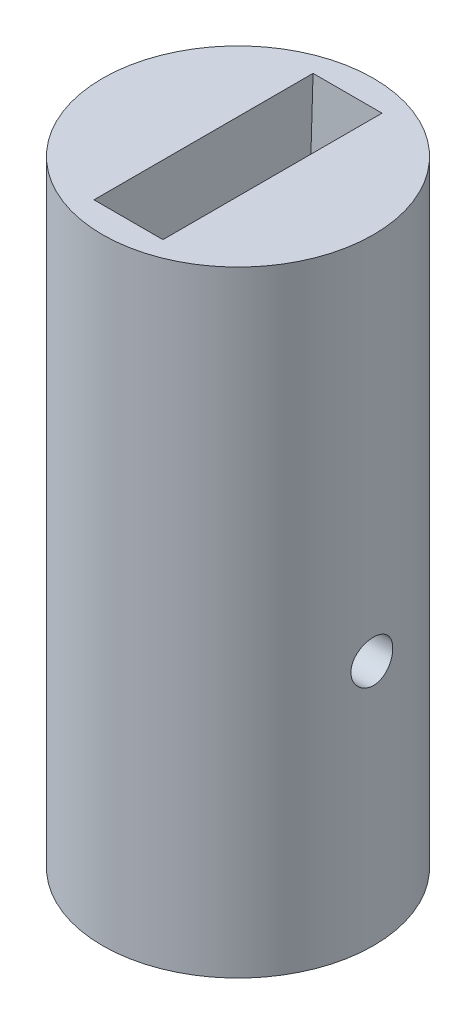
ISO-10303-21;
HEADER;
FILE_DESCRIPTION(('STEP AP214'),'2;1');
FILE_NAME('part.step','',(''),(''),'','','');
FILE_SCHEMA(('AUTOMOTIVE_DESIGN { 1 0 10303 214 1 1 1 1 }'));
ENDSEC;
DATA;
#1=APPLICATION_CONTEXT('core data for automotive mechanical design processes');
#2=APPLICATION_PROTOCOL_DEFINITION('international standard','automotive_design',2000,#1);
#3=PRODUCT_CONTEXT('',#1,'mechanical');
#4=PRODUCT('Part','Part','',(#3));
#5=PRODUCT_RELATED_PRODUCT_CATEGORY('part','',(#4));
#6=PRODUCT_DEFINITION_FORMATION('','',#4);
#7=PRODUCT_DEFINITION_CONTEXT('part definition',#1,'design');
#8=PRODUCT_DEFINITION('design','',#6,#7);
#9=PRODUCT_DEFINITION_SHAPE('','',#8);
#10=(LENGTH_UNIT() NAMED_UNIT(*) SI_UNIT(.MILLI.,.METRE.));
#11=(NAMED_UNIT(*) PLANE_ANGLE_UNIT() SI_UNIT($,.RADIAN.));
#12=(NAMED_UNIT(*) SI_UNIT($,.STERADIAN.) SOLID_ANGLE_UNIT());
#13=UNCERTAINTY_MEASURE_WITH_UNIT(LENGTH_MEASURE(1.E-05),#10,'distance_accuracy_value','');
#14=(GEOMETRIC_REPRESENTATION_CONTEXT(3) GLOBAL_UNCERTAINTY_ASSIGNED_CONTEXT((#13)) GLOBAL_UNIT_ASSIGNED_CONTEXT((#10,
#11,#12)) REPRESENTATION_CONTEXT('',''));
#15=CARTESIAN_POINT('',(0.,0.,0.));
#16=DIRECTION('',(0.,0.,1.));
#17=DIRECTION('',(1.,0.,0.));
#18=AXIS2_PLACEMENT_3D('',#15,#16,#17);
#19=CARTESIAN_POINT('',(0.,-335.,-11.));
#20=DIRECTION('',(0.,1.,0.));
#21=DIRECTION('',(0.,0.,1.));
#22=AXIS2_PLACEMENT_3D('',#19,#20,#21);
#23=PLANE('',#22);
#24=CARTESIAN_POINT('',(0.,-335.,0.));
#25=DIRECTION('',(0.,-1.,0.));
#26=DIRECTION('',(0.,0.,-1.));
#27=AXIS2_PLACEMENT_3D('',#24,#25,#26);
#28=CIRCLE('',#27,11.);
#29=CARTESIAN_POINT('',(0.,-335.,-11.));
#30=VERTEX_POINT('',#29);
#31=EDGE_CURVE('E129',#30,#30,#28,.T.);
#32=ORIENTED_EDGE('',*,*,#31,.F.);
#33=EDGE_LOOP('',(#32));
#34=FACE_BOUND('',#33,.T.);
#35=DIRECTION('',(-1.,0.,0.));
#36=VECTOR('',#35,1.);
#37=CARTESIAN_POINT('',(0.,-335.,8.89487826114935));
#38=LINE('',#37,#36);
#39=CARTESIAN_POINT('',(2.8,-335.,8.89487826114934));
#40=VERTEX_POINT('',#39);
#41=CARTESIAN_POINT('',(-2.8,-335.,8.89487826114934));
#42=VERTEX_POINT('',#41);
#43=EDGE_CURVE('E141',#40,#42,#38,.T.);
#44=ORIENTED_EDGE('',*,*,#43,.T.);
#45=DIRECTION('',(0.,0.,-1.));
#46=VECTOR('',#45,1.);
#47=CARTESIAN_POINT('',(-2.8,-335.,-11.));
#48=LINE('',#47,#46);
#49=CARTESIAN_POINT('',(-2.8,-335.,-8.89487826114943));
#50=VERTEX_POINT('',#49);
#51=EDGE_CURVE('E75',#42,#50,#48,.T.);
#52=ORIENTED_EDGE('',*,*,#51,.T.);
#53=DIRECTION('',(-1.,0.,0.));
#54=VECTOR('',#53,1.);
#55=CARTESIAN_POINT('',(0.,-335.,-8.89487826114943));
#56=LINE('',#55,#54);
#57=CARTESIAN_POINT('',(2.8,-335.,-8.89487826114943));
#58=VERTEX_POINT('',#57);
#59=EDGE_CURVE('E144',#58,#50,#56,.T.);
#60=ORIENTED_EDGE('',*,*,#59,.F.);
#61=DIRECTION('',(0.,0.,-1.));
#62=VECTOR('',#61,1.);
#63=CARTESIAN_POINT('',(2.8,-335.,-11.));
#64=LINE('',#63,#62);
#65=EDGE_CURVE('E138',#40,#58,#64,.T.);
#66=ORIENTED_EDGE('',*,*,#65,.F.);
#67=EDGE_LOOP('',(#44,#52,#60,#66));
#68=FACE_BOUND('',#67,.T.);
#69=ADVANCED_FACE('F47',(#34,#68),#23,.T.);
#70=CARTESIAN_POINT('',(0.,-385.,0.));
#71=DIRECTION('',(0.,-1.,0.));
#72=DIRECTION('',(0.,0.,-1.));
#73=AXIS2_PLACEMENT_3D('',#70,#71,#72);
#74=PLANE('',#73);
#75=CARTESIAN_POINT('',(0.,-385.,0.));
#76=DIRECTION('',(0.,-1.,0.));
#77=DIRECTION('',(0.,0.,-1.));
#78=AXIS2_PLACEMENT_3D('',#75,#76,#77);
#79=CIRCLE('',#78,11.);
#80=CARTESIAN_POINT('',(0.,-385.,-11.));
#81=VERTEX_POINT('',#80);
#82=EDGE_CURVE('E134',#81,#81,#79,.T.);
#83=ORIENTED_EDGE('',*,*,#82,.T.);
#84=EDGE_LOOP('',(#83));
#85=FACE_BOUND('',#84,.T.);
#86=ADVANCED_FACE('F49',(#85),#74,.T.);
#87=CARTESIAN_POINT('',(0.,-385.,0.));
#88=DIRECTION('',(0.,-1.,0.));
#89=DIRECTION('',(0.,0.,-1.));
#90=AXIS2_PLACEMENT_3D('',#87,#88,#89);
#91=CYLINDRICAL_SURFACE('',#90,11.);
#92=CARTESIAN_POINT('',(-11.,-366.7,0.));
#93=CARTESIAN_POINT('',(-10.9999984482941,-366.699996114041,0.0948835861591596));
#94=CARTESIAN_POINT('',(-10.9987594870093,-366.692029446768,0.189821371080059));
#95=CARTESIAN_POINT('',(-10.9939362822614,-366.66038269678,0.37704090923463));
#96=CARTESIAN_POINT('',(-10.9903497885905,-366.636687537342,0.469320025330165));
#97=CARTESIAN_POINT('',(-10.9812343585268,-366.574310740772,0.648485891342021));
#98=CARTESIAN_POINT('',(-10.975706922455,-366.535640676663,0.735376745442714));
#99=CARTESIAN_POINT('',(-10.9633195919169,-366.444440597443,0.90142366978662));
#100=CARTESIAN_POINT('',(-10.9564598739117,-366.391912417513,0.980580762283575));
#101=CARTESIAN_POINT('',(-10.9421067251764,-366.274024404709,1.12958068695421));
#102=CARTESIAN_POINT('',(-10.9346089811336,-366.2085725059,1.19935026926988));
#103=CARTESIAN_POINT('',(-10.9198583855495,-366.06689313283,1.32696248394103));
#104=CARTESIAN_POINT('',(-10.9126055484642,-365.990665023865,1.38480441327966));
#105=CARTESIAN_POINT('',(-10.8991241357353,-365.829101960889,1.48720679156915));
#106=CARTESIAN_POINT('',(-10.8929011346534,-365.74372131749,1.53169595277506));
#107=CARTESIAN_POINT('',(-10.8822431391782,-365.566587094549,1.60567426215004));
#108=CARTESIAN_POINT('',(-10.8778080412662,-365.474833884336,1.63516427878734));
#109=CARTESIAN_POINT('',(-10.8712705636067,-365.288331098517,1.67807881398665));
#110=CARTESIAN_POINT('',(-10.8691499429063,-365.193611096094,1.69162902500299));
#111=CARTESIAN_POINT('',(-10.8674262006969,-365.003219855432,1.70266877817375));
#112=CARTESIAN_POINT('',(-10.8678229258558,-364.907548675484,1.70015929852827));
#113=CARTESIAN_POINT('',(-10.871072376853,-364.718861185218,1.67925353439083));
#114=CARTESIAN_POINT('',(-10.8739034115981,-364.625828902107,1.66099755577315));
#115=CARTESIAN_POINT('',(-10.8816685931841,-364.444163979195,1.60933679398689));
#116=CARTESIAN_POINT('',(-10.8866028028604,-364.355531470933,1.5759315582114));
#117=CARTESIAN_POINT('',(-10.8980421943044,-364.18475696404,1.49477557620756));
#118=CARTESIAN_POINT('',(-10.9045538284425,-364.102643511655,1.44696570761989));
#119=CARTESIAN_POINT('',(-10.9184097575467,-363.947551454328,1.33839967765817));
#120=CARTESIAN_POINT('',(-10.9257541104525,-363.874573485767,1.27764261517286));
#121=CARTESIAN_POINT('',(-10.9405436543939,-363.739011073384,1.14413820456969));
#122=CARTESIAN_POINT('',(-10.947989087583,-363.6765453302,1.07127029088421));
#123=CARTESIAN_POINT('',(-10.9620694815853,-363.56471102439,0.916022716930924));
#124=CARTESIAN_POINT('',(-10.9687044384429,-363.515342525685,0.833643010244094));
#125=CARTESIAN_POINT('',(-10.9804238583599,-363.431096765755,0.66160513033243));
#126=CARTESIAN_POINT('',(-10.9855073036549,-363.396229011349,0.571942228070129));
#127=CARTESIAN_POINT('',(-10.9935425210384,-363.342079526527,0.3879373509025));
#128=CARTESIAN_POINT('',(-10.9964944461937,-363.322796676928,0.293595712502456));
#129=CARTESIAN_POINT('',(-10.9999136674749,-363.300523017503,0.103935482200981));
#130=CARTESIAN_POINT('',(-11.0004058401472,-363.297369081354,0.0086364800028967));
#131=CARTESIAN_POINT('',(-10.9989179282333,-363.307009286892,-0.181129187088976));
#132=CARTESIAN_POINT('',(-10.9969379250371,-363.319802903547,-0.2755958792813));
#133=CARTESIAN_POINT('',(-10.9907435241059,-363.36083939177,-0.460518687924851));
#134=CARTESIAN_POINT('',(-10.9865406729215,-363.389002450853,-0.550992935702459));
#135=CARTESIAN_POINT('',(-10.9763701942557,-363.45989397147,-0.725935505076977));
#136=CARTESIAN_POINT('',(-10.9704024795273,-363.502623153105,-0.810403529496769));
#137=CARTESIAN_POINT('',(-10.9573033380014,-363.601814305523,-0.971650929896884));
#138=CARTESIAN_POINT('',(-10.9501633164111,-363.658379339425,-1.04836619550485));
#139=CARTESIAN_POINT('',(-10.9355401140615,-363.78349348591,-1.19127336441716));
#140=CARTESIAN_POINT('',(-10.9280569120829,-363.852043340269,-1.25746461587481));
#141=CARTESIAN_POINT('',(-10.9135114592572,-363.999908907746,-1.37804132106791));
#142=CARTESIAN_POINT('',(-10.9064535163769,-364.079314468363,-1.43231719257245));
#143=CARTESIAN_POINT('',(-10.8936350924952,-364.246211481164,-1.5267598010762));
#144=CARTESIAN_POINT('',(-10.8878745747709,-364.333702704387,-1.56692693743347));
#145=CARTESIAN_POINT('',(-10.8783347196967,-364.513966082935,-1.63184359330707));
#146=CARTESIAN_POINT('',(-10.8745480860466,-364.606717364013,-1.6566499575071));
#147=CARTESIAN_POINT('',(-10.8693656207855,-364.795132764294,-1.69032131981383));
#148=CARTESIAN_POINT('',(-10.8679696129772,-364.890796668297,-1.6991874927689));
#149=CARTESIAN_POINT('',(-10.8677333100088,-365.081229023848,-1.70069757386015));
#150=CARTESIAN_POINT('',(-10.8688658628954,-365.175996119818,-1.69351382715235));
#151=CARTESIAN_POINT('',(-10.8734999309301,-365.362956842048,-1.66349819321618));
#152=CARTESIAN_POINT('',(-10.8770014413261,-365.455150473469,-1.64066633737834));
#153=CARTESIAN_POINT('',(-10.8859691815259,-365.63429448742,-1.58006489669288));
#154=CARTESIAN_POINT('',(-10.8914337295525,-365.721249283937,-1.54230809560071));
#155=CARTESIAN_POINT('',(-10.9037137579129,-365.887618016035,-1.45294581870582));
#156=CARTESIAN_POINT('',(-10.9105292896369,-365.967031664585,-1.40133981606523));
#157=CARTESIAN_POINT('',(-10.9248303291796,-366.116938213669,-1.28512076911688));
#158=CARTESIAN_POINT('',(-10.9323219673672,-366.187331747174,-1.22038029370602));
#159=CARTESIAN_POINT('',(-10.9470805276916,-366.316316300303,-1.07999933897267));
#160=CARTESIAN_POINT('',(-10.9543473973068,-366.374904578781,-1.00435633509207));
#161=CARTESIAN_POINT('',(-10.9678865239925,-366.478924477888,-0.843794106977354));
#162=CARTESIAN_POINT('',(-10.9741526991237,-366.524276937728,-0.758823090810682));
#163=CARTESIAN_POINT('',(-10.9849249372308,-366.599997474261,-0.582411201886344));
#164=CARTESIAN_POINT('',(-10.9894328038745,-366.630380914595,-0.4909770733392));
#165=CARTESIAN_POINT('',(-10.9951633494357,-366.668485987203,-0.332622335541474));
#166=CARTESIAN_POINT('',(-10.99696767936,-366.68028545628,-0.266674303699763));
#167=CARTESIAN_POINT('',(-10.9993865438033,-366.696043779848,-0.133826494390419));
#168=CARTESIAN_POINT('',(-11.0000010945054,-366.700002740985,-0.0669267298805269));
#169=CARTESIAN_POINT('',(-11.,-366.7,0.));
#170=B_SPLINE_CURVE_WITH_KNOTS('',3,(#92,#93,#94,#95,#96,#97,#98,#99,#100,#101,#102,#103,#104,
#105,#106,#107,#108,#109,#110,#111,#112,#113,#114,#115,#116,#117,#118,#119,#120,#121,#122,#123,
#124,#125,#126,#127,#128,#129,#130,#131,#132,#133,#134,#135,#136,#137,#138,#139,#140,#141,#142,
#143,#144,#145,#146,#147,#148,#149,#150,#151,#152,#153,#154,#155,#156,#157,#158,#159,#160,#161,
#162,#163,#164,#165,#166,#167,#168,#169),.UNSPECIFIED.,.T.,.F.,(4,2,2,2,2,2,2,2,2,2,2,2,2,2,2,2,
2,2,2,2,2,2,2,2,2,2,2,2,2,2,2,2,2,2,2,2,2,2,4),(0.,0.284406180490921,0.569085376190758,
0.853545001563855,1.13796697586066,1.42449339309025,1.71103669338635,1.99908363844876,
2.28711390335252,2.57285736387829,2.85858341985805,3.1417895686455,3.42500417920124,
3.70939742827197,3.99381047728633,4.28124615091228,4.56868322732833,4.85630845416485,
5.14391302426058,5.42860295358362,5.7132835104769,5.99649961596958,6.27972972474854,
6.56513754395017,6.85056303413968,7.1385127068005,7.42645422817845,7.71332371199968,
8.00017205166047,8.28395501424683,8.56773740755837,8.85127725585748,9.1348278918337,
9.42127378924164,9.70778612211766,9.99597847022155,10.2838744090414,10.4844848127541,
10.6850924877859),.UNSPECIFIED.);
#171=CARTESIAN_POINT('',(-11.,-366.7,0.));
#172=VERTEX_POINT('',#171);
#173=EDGE_CURVE('E11',#172,#172,#170,.T.);
#174=ORIENTED_EDGE('',*,*,#173,.F.);
#175=EDGE_LOOP('',(#174));
#176=FACE_BOUND('',#175,.T.);
#177=CARTESIAN_POINT('',(11.,-366.7,0.));
#178=CARTESIAN_POINT('',(10.9999984482941,-366.699996114041,-0.0948835861591678));
#179=CARTESIAN_POINT('',(10.9987594870093,-366.692029446768,-0.189821371080073));
#180=CARTESIAN_POINT('',(10.9939362822614,-366.66038269678,-0.377040909234644));
#181=CARTESIAN_POINT('',(10.9903497885905,-366.636687537342,-0.469320025330173));
#182=CARTESIAN_POINT('',(10.9812343585268,-366.574310740772,-0.648485891342038));
#183=CARTESIAN_POINT('',(10.975706922455,-366.535640676663,-0.735376745442748));
#184=CARTESIAN_POINT('',(10.9633195919169,-366.444440597444,-0.901423669786665));
#185=CARTESIAN_POINT('',(10.9564598739117,-366.391912417513,-0.980580762283615));
#186=CARTESIAN_POINT('',(10.9421067251764,-366.274024404709,-1.12958068695423));
#187=CARTESIAN_POINT('',(10.9346089811336,-366.2085725059,-1.1993502692699));
#188=CARTESIAN_POINT('',(10.9198583855495,-366.06689313283,-1.32696248394105));
#189=CARTESIAN_POINT('',(10.9126055484642,-365.990665023865,-1.38480441327969));
#190=CARTESIAN_POINT('',(10.8991241357353,-365.829101960889,-1.48720679156919));
#191=CARTESIAN_POINT('',(10.8929011346534,-365.74372131749,-1.53169595277509));
#192=CARTESIAN_POINT('',(10.8822431391782,-365.566587094549,-1.60567426215009));
#193=CARTESIAN_POINT('',(10.8778080412662,-365.474833884336,-1.63516427878741));
#194=CARTESIAN_POINT('',(10.8712705636067,-365.288331098517,-1.67807881398672));
#195=CARTESIAN_POINT('',(10.8691499429063,-365.193611096094,-1.69162902500307));
#196=CARTESIAN_POINT('',(10.8674262006969,-365.003219855432,-1.70266877817384));
#197=CARTESIAN_POINT('',(10.8678229258558,-364.907548675484,-1.70015929852836));
#198=CARTESIAN_POINT('',(10.871072376853,-364.718861185219,-1.67925353439094));
#199=CARTESIAN_POINT('',(10.8739034115981,-364.625828902107,-1.66099755577327));
#200=CARTESIAN_POINT('',(10.8816685931841,-364.444163979195,-1.60933679398701));
#201=CARTESIAN_POINT('',(10.8866028028603,-364.355531470933,-1.57593155821152));
#202=CARTESIAN_POINT('',(10.8980421943044,-364.18475696404,-1.49477557620769));
#203=CARTESIAN_POINT('',(10.9045538284425,-364.102643511656,-1.44696570762003));
#204=CARTESIAN_POINT('',(10.9184097575467,-363.947551454328,-1.33839967765832));
#205=CARTESIAN_POINT('',(10.9257541104525,-363.874573485767,-1.27764261517301));
#206=CARTESIAN_POINT('',(10.9405436543939,-363.739011073384,-1.14413820456983));
#207=CARTESIAN_POINT('',(10.947989087583,-363.6765453302,-1.07127029088434));
#208=CARTESIAN_POINT('',(10.9620694815853,-363.56471102439,-0.916022716931042));
#209=CARTESIAN_POINT('',(10.9687044384429,-363.515342525685,-0.83364301024421));
#210=CARTESIAN_POINT('',(10.9804238583599,-363.431096765755,-0.661605130332544));
#211=CARTESIAN_POINT('',(10.9855073036549,-363.396229011349,-0.571942228070246));
#212=CARTESIAN_POINT('',(10.9935425210384,-363.342079526527,-0.387937350902628));
#213=CARTESIAN_POINT('',(10.9964944461937,-363.322796676929,-0.293595712502593));
#214=CARTESIAN_POINT('',(10.9999136674749,-363.300523017503,-0.103935482201125));
#215=CARTESIAN_POINT('',(11.0004058401472,-363.297369081354,-0.00863648000303996));
#216=CARTESIAN_POINT('',(10.9989179282333,-363.307009286892,0.181129187088832));
#217=CARTESIAN_POINT('',(10.9969379250371,-363.319802903547,0.275595879281154));
#218=CARTESIAN_POINT('',(10.9907435241059,-363.36083939177,0.4605186879247));
#219=CARTESIAN_POINT('',(10.9865406729215,-363.389002450853,0.550992935702304));
#220=CARTESIAN_POINT('',(10.9763701942557,-363.45989397147,0.725935505076819));
#221=CARTESIAN_POINT('',(10.9704024795273,-363.502623153105,0.81040352949661));
#222=CARTESIAN_POINT('',(10.9573033380014,-363.601814305523,0.971650929896735));
#223=CARTESIAN_POINT('',(10.9501633164111,-363.658379339425,1.04836619550472));
#224=CARTESIAN_POINT('',(10.9355401140615,-363.78349348591,1.19127336441703));
#225=CARTESIAN_POINT('',(10.9280569120829,-363.852043340269,1.25746461587468));
#226=CARTESIAN_POINT('',(10.9135114592572,-363.999908907745,1.37804132106779));
#227=CARTESIAN_POINT('',(10.9064535163769,-364.079314468363,1.43231719257235));
#228=CARTESIAN_POINT('',(10.8936350924952,-364.246211481164,1.5267598010761));
#229=CARTESIAN_POINT('',(10.8878745747709,-364.333702704387,1.56692693743336));
#230=CARTESIAN_POINT('',(10.8783347196967,-364.513966082935,1.63184359330696));
#231=CARTESIAN_POINT('',(10.8745480860467,-364.606717364013,1.65664995750699));
#232=CARTESIAN_POINT('',(10.8693656207855,-364.795132764294,1.69032131981373));
#233=CARTESIAN_POINT('',(10.8679696129772,-364.890796668297,1.6991874927688));
#234=CARTESIAN_POINT('',(10.8677333100088,-365.081229023848,1.70069757386006));
#235=CARTESIAN_POINT('',(10.8688658628954,-365.175996119818,1.69351382715227));
#236=CARTESIAN_POINT('',(10.8734999309301,-365.362956842048,1.6634981932161));
#237=CARTESIAN_POINT('',(10.8770014413261,-365.455150473469,1.64066633737826));
#238=CARTESIAN_POINT('',(10.8859691815259,-365.63429448742,1.58006489669282));
#239=CARTESIAN_POINT('',(10.8914337295525,-365.721249283937,1.54230809560064));
#240=CARTESIAN_POINT('',(10.9037137579129,-365.887618016034,1.45294581870577));
#241=CARTESIAN_POINT('',(10.9105292896369,-365.967031664585,1.40133981606518));
#242=CARTESIAN_POINT('',(10.9248303291796,-366.116938213669,1.28512076911683));
#243=CARTESIAN_POINT('',(10.9323219673672,-366.187331747174,1.22038029370597));
#244=CARTESIAN_POINT('',(10.9470805276916,-366.316316300303,1.07999933897265));
#245=CARTESIAN_POINT('',(10.9543473973068,-366.374904578781,1.00435633509206));
#246=CARTESIAN_POINT('',(10.9678865239925,-366.478924477888,0.843794106977352));
#247=CARTESIAN_POINT('',(10.9741526991237,-366.524276937728,0.758823090810668));
#248=CARTESIAN_POINT('',(10.9849249372308,-366.599997474261,0.58241120188632));
#249=CARTESIAN_POINT('',(10.9894328038745,-366.630380914595,0.490977073339176));
#250=CARTESIAN_POINT('',(10.9951633494357,-366.668485987203,0.332622335541447));
#251=CARTESIAN_POINT('',(10.99696767936,-366.68028545628,0.266674303699738));
#252=CARTESIAN_POINT('',(10.9993865438033,-366.696043779848,0.133826494390402));
#253=CARTESIAN_POINT('',(11.0000010945054,-366.700002740985,0.0669267298805157));
#254=CARTESIAN_POINT('',(11.,-366.7,0.));
#255=B_SPLINE_CURVE_WITH_KNOTS('',3,(#177,#178,#179,#180,#181,#182,#183,#184,#185,#186,#187,
#188,#189,#190,#191,#192,#193,#194,#195,#196,#197,#198,#199,#200,#201,#202,#203,#204,#205,#206,
#207,#208,#209,#210,#211,#212,#213,#214,#215,#216,#217,#218,#219,#220,#221,#222,#223,#224,#225,
#226,#227,#228,#229,#230,#231,#232,#233,#234,#235,#236,#237,#238,#239,#240,#241,#242,#243,#244,
#245,#246,#247,#248,#249,#250,#251,#252,#253,#254),.UNSPECIFIED.,.T.,.F.,(4,2,2,2,2,2,2,2,2,2,2,
2,2,2,2,2,2,2,2,2,2,2,2,2,2,2,2,2,2,2,2,2,2,2,2,2,2,2,4),(0.,0.284406180490919,
0.569085376190775,0.853545001563872,1.13796697586068,1.42449339309025,1.71103669338636,
1.99908363844867,2.28711390335255,2.57285736387827,2.85858341985802,3.14178956864552,
3.42500417920127,3.70939742827193,3.99381047728634,4.28124615091235,4.5686832273284,
4.85630845416489,5.1439130242606,5.42860295358365,5.71328351047691,5.99649961596958,
6.27972972474858,6.56513754395022,6.85056303413969,7.13851270680058,7.42645422817847,
7.71332371199965,8.00017205166049,8.28395501424686,8.5677374075584,8.8512772558575,
9.13482789183371,9.42127378924163,9.70778612211767,9.99597847022154,10.2838744090415,
10.4844848127542,10.6850924877859),.UNSPECIFIED.);
#256=CARTESIAN_POINT('',(11.,-366.7,0.));
#257=VERTEX_POINT('',#256);
#258=EDGE_CURVE('E60',#257,#257,#255,.T.);
#259=ORIENTED_EDGE('',*,*,#258,.F.);
#260=EDGE_LOOP('',(#259));
#261=FACE_BOUND('',#260,.T.);
#262=ORIENTED_EDGE('',*,*,#31,.T.);
#263=EDGE_LOOP('',(#262));
#264=FACE_BOUND('',#263,.T.);
#265=ORIENTED_EDGE('',*,*,#82,.F.);
#266=EDGE_LOOP('',(#265));
#267=FACE_BOUND('',#266,.T.);
#268=ADVANCED_FACE('F154',(#176,#261,#264,#267),#91,.T.);
#269=CARTESIAN_POINT('',(-2.8,-0.597022337588315,-19.2604659057032));
#270=DIRECTION('',(0.,-0.030982413814232,-0.999519929783416));
#271=DIRECTION('',(0.,0.999519929783416,-0.030982413814232));
#272=AXIS2_PLACEMENT_3D('',#269,#270,#271);
#273=PLANE('',#272);
#274=ORIENTED_EDGE('',*,*,#59,.T.);
#275=DIRECTION('',(0.,0.999519929783416,-0.030982413814232));
#276=VECTOR('',#275,1.);
#277=CARTESIAN_POINT('',(-2.8,-0.597022337588315,-19.2604659057032));
#278=LINE('',#277,#276);
#279=CARTESIAN_POINT('',(-2.8,-380.,-7.50000000000005));
#280=VERTEX_POINT('',#279);
#281=EDGE_CURVE('E103',#280,#50,#278,.T.);
#282=ORIENTED_EDGE('',*,*,#281,.F.);
#283=DIRECTION('',(1.,0.,0.));
#284=VECTOR('',#283,1.);
#285=CARTESIAN_POINT('',(-2.8,-380.,-7.50000000000005));
#286=LINE('',#285,#284);
#287=CARTESIAN_POINT('',(2.8,-380.,-7.50000000000005));
#288=VERTEX_POINT('',#287);
#289=EDGE_CURVE('E102',#280,#288,#286,.T.);
#290=ORIENTED_EDGE('',*,*,#289,.T.);
#291=DIRECTION('',(0.,0.999519929783416,-0.030982413814232));
#292=VECTOR('',#291,1.);
#293=CARTESIAN_POINT('',(2.8,-0.597022337588315,-19.2604659057032));
#294=LINE('',#293,#292);
#295=EDGE_CURVE('E110',#288,#58,#294,.T.);
#296=ORIENTED_EDGE('',*,*,#295,.T.);
#297=EDGE_LOOP('',(#274,#282,#290,#296));
#298=FACE_BOUND('',#297,.T.);
#299=ADVANCED_FACE('F171',(#298),#273,.F.);
#300=CARTESIAN_POINT('',(-2.8,-380.,0.));
#301=DIRECTION('',(0.,-1.,0.));
#302=DIRECTION('',(0.,0.,-1.));
#303=AXIS2_PLACEMENT_3D('',#300,#301,#302);
#304=PLANE('',#303);
#305=DIRECTION('',(0.,0.,-1.));
#306=VECTOR('',#305,1.);
#307=CARTESIAN_POINT('',(2.8,-380.,0.));
#308=LINE('',#307,#306);
#309=CARTESIAN_POINT('',(2.8,-380.,7.49999999999995));
#310=VERTEX_POINT('',#309);
#311=EDGE_CURVE('E121',#310,#288,#308,.T.);
#312=ORIENTED_EDGE('',*,*,#311,.T.);
#313=ORIENTED_EDGE('',*,*,#289,.F.);
#314=DIRECTION('',(0.,0.,-1.));
#315=VECTOR('',#314,1.);
#316=CARTESIAN_POINT('',(-2.8,-380.,0.));
#317=LINE('',#316,#315);
#318=CARTESIAN_POINT('',(-2.8,-380.,7.49999999999995));
#319=VERTEX_POINT('',#318);
#320=EDGE_CURVE('E107',#319,#280,#317,.T.);
#321=ORIENTED_EDGE('',*,*,#320,.F.);
#322=DIRECTION('',(1.,0.,0.));
#323=VECTOR('',#322,1.);
#324=CARTESIAN_POINT('',(-2.8,-380.,7.49999999999995));
#325=LINE('',#324,#323);
#326=EDGE_CURVE('E94',#319,#310,#325,.T.);
#327=ORIENTED_EDGE('',*,*,#326,.T.);
#328=EDGE_LOOP('',(#312,#313,#321,#327));
#329=FACE_BOUND('',#328,.T.);
#330=ADVANCED_FACE('F112',(#329),#304,.F.);
#331=CARTESIAN_POINT('',(-2.8,-0.597022337588319,19.2604659057032));
#332=DIRECTION('',(0.,0.0309824138142322,-0.999519929783416));
#333=DIRECTION('',(0.,0.999519929783416,0.0309824138142322));
#334=AXIS2_PLACEMENT_3D('',#331,#332,#333);
#335=PLANE('',#334);
#336=DIRECTION('',(0.,0.999519929783416,0.0309824138142322));
#337=VECTOR('',#336,1.);
#338=CARTESIAN_POINT('',(2.8,-0.597022337588319,19.2604659057032));
#339=LINE('',#338,#337);
#340=EDGE_CURVE('E67',#310,#40,#339,.T.);
#341=ORIENTED_EDGE('',*,*,#340,.F.);
#342=ORIENTED_EDGE('',*,*,#326,.F.);
#343=DIRECTION('',(0.,0.999519929783416,0.0309824138142322));
#344=VECTOR('',#343,1.);
#345=CARTESIAN_POINT('',(-2.8,-0.597022337588319,19.2604659057032));
#346=LINE('',#345,#344);
#347=EDGE_CURVE('E96',#319,#42,#346,.T.);
#348=ORIENTED_EDGE('',*,*,#347,.T.);
#349=ORIENTED_EDGE('',*,*,#43,.F.);
#350=EDGE_LOOP('',(#341,#342,#348,#349));
#351=FACE_BOUND('',#350,.T.);
#352=ADVANCED_FACE('F95',(#351),#335,.T.);
#353=CARTESIAN_POINT('',(-2.8,0.,0.));
#354=DIRECTION('',(1.,0.,0.));
#355=DIRECTION('',(0.,0.,-1.));
#356=AXIS2_PLACEMENT_3D('',#353,#354,#355);
#357=PLANE('',#356);
#358=CARTESIAN_POINT('',(-2.8,-365.,0.));
#359=DIRECTION('',(1.,0.,0.));
#360=DIRECTION('',(0.,0.,-1.));
#361=AXIS2_PLACEMENT_3D('',#358,#359,#360);
#362=CIRCLE('',#361,1.69999999999998);
#363=CARTESIAN_POINT('',(-2.8,-365.,-1.70000000000002));
#364=VERTEX_POINT('',#363);
#365=EDGE_CURVE('E203',#364,#364,#362,.T.);
#366=ORIENTED_EDGE('',*,*,#365,.F.);
#367=EDGE_LOOP('',(#366));
#368=FACE_BOUND('',#367,.T.);
#369=ORIENTED_EDGE('',*,*,#347,.F.);
#370=ORIENTED_EDGE('',*,*,#320,.T.);
#371=ORIENTED_EDGE('',*,*,#281,.T.);
#372=ORIENTED_EDGE('',*,*,#51,.F.);
#373=EDGE_LOOP('',(#369,#370,#371,#372));
#374=FACE_BOUND('',#373,.T.);
#375=ADVANCED_FACE('F106',(#368,#374),#357,.T.);
#376=CARTESIAN_POINT('',(2.8,0.,0.));
#377=DIRECTION('',(1.,0.,0.));
#378=DIRECTION('',(0.,0.,-1.));
#379=AXIS2_PLACEMENT_3D('',#376,#377,#378);
#380=PLANE('',#379);
#381=CARTESIAN_POINT('',(2.8,-365.,0.));
#382=DIRECTION('',(1.,0.,0.));
#383=DIRECTION('',(0.,0.,-1.));
#384=AXIS2_PLACEMENT_3D('',#381,#382,#383);
#385=CIRCLE('',#384,1.69999999999998);
#386=CARTESIAN_POINT('',(2.8,-365.,-1.70000000000002));
#387=VERTEX_POINT('',#386);
#388=EDGE_CURVE('E122',#387,#387,#385,.T.);
#389=ORIENTED_EDGE('',*,*,#388,.T.);
#390=EDGE_LOOP('',(#389));
#391=FACE_BOUND('',#390,.T.);
#392=ORIENTED_EDGE('',*,*,#65,.T.);
#393=ORIENTED_EDGE('',*,*,#295,.F.);
#394=ORIENTED_EDGE('',*,*,#311,.F.);
#395=ORIENTED_EDGE('',*,*,#340,.T.);
#396=EDGE_LOOP('',(#392,#393,#394,#395));
#397=FACE_BOUND('',#396,.T.);
#398=ADVANCED_FACE('F162',(#391,#397),#380,.F.);
#399=CARTESIAN_POINT('',(0.,-365.,0.));
#400=DIRECTION('',(-1.,0.,0.));
#401=DIRECTION('',(0.,0.,1.));
#402=AXIS2_PLACEMENT_3D('',#399,#400,#401);
#403=CYLINDRICAL_SURFACE('',#402,1.69999999999998);
#404=ORIENTED_EDGE('',*,*,#258,.T.);
#405=EDGE_LOOP('',(#404));
#406=FACE_BOUND('',#405,.T.);
#407=ORIENTED_EDGE('',*,*,#388,.F.);
#408=EDGE_LOOP('',(#407));
#409=FACE_BOUND('',#408,.T.);
#410=ADVANCED_FACE('F157',(#406,#409),#403,.F.);
#411=CARTESIAN_POINT('',(0.,-365.,0.));
#412=DIRECTION('',(1.,0.,0.));
#413=DIRECTION('',(0.,0.,-1.));
#414=AXIS2_PLACEMENT_3D('',#411,#412,#413);
#415=CYLINDRICAL_SURFACE('',#414,1.69999999999998);
#416=ORIENTED_EDGE('',*,*,#365,.T.);
#417=EDGE_LOOP('',(#416));
#418=FACE_BOUND('',#417,.T.);
#419=ORIENTED_EDGE('',*,*,#173,.T.);
#420=EDGE_LOOP('',(#419));
#421=FACE_BOUND('',#420,.T.);
#422=ADVANCED_FACE('F161',(#418,#421),#415,.F.);
#423=CLOSED_SHELL('',(#69,#86,#268,#299,#330,#352,#375,#398,#410,#422));
#424=MANIFOLD_SOLID_BREP('B2',#423);
#425=ADVANCED_BREP_SHAPE_REPRESENTATION('',(#18,#424),#14);
#426=SHAPE_DEFINITION_REPRESENTATION(#9,#425);
ENDSEC;
END-ISO-10303-21;
